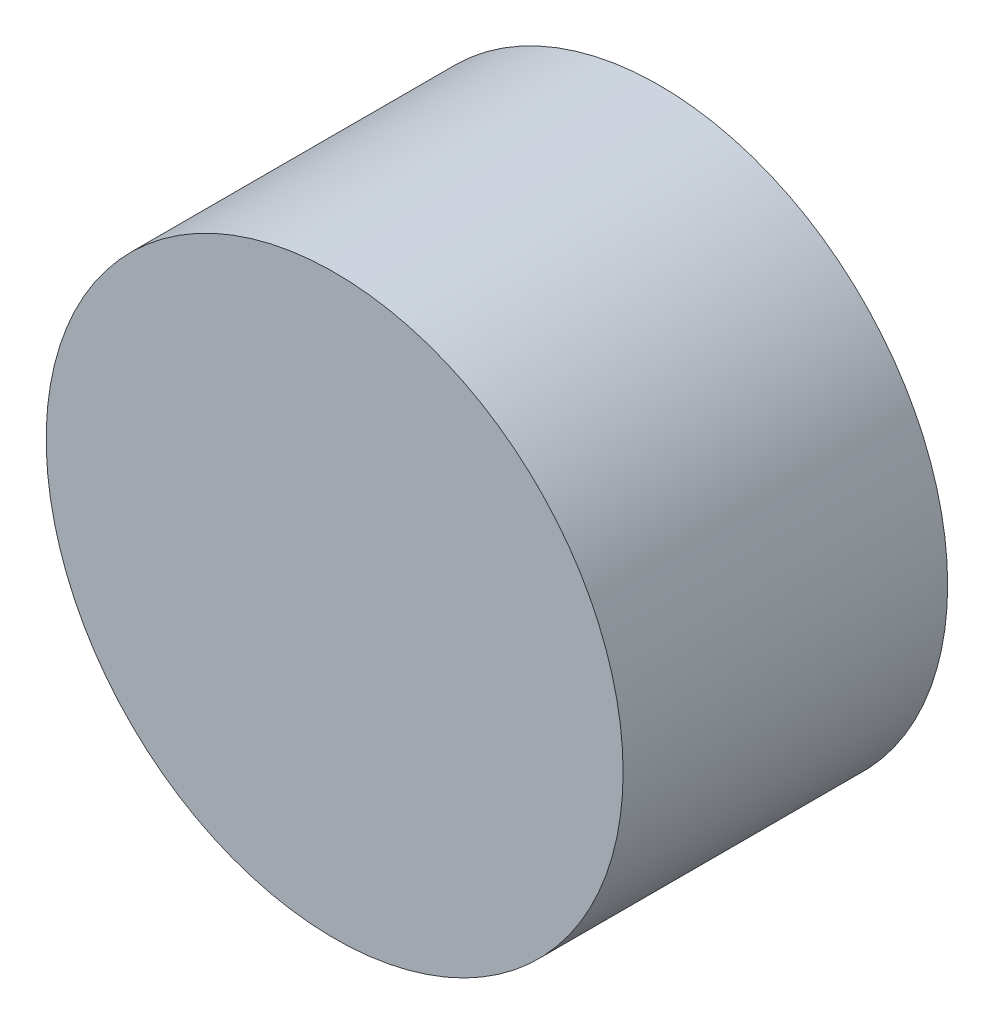
ISO-10303-21;
HEADER;
FILE_DESCRIPTION(('STEP AP214'),'2;1');
FILE_NAME('part.step','',(''),(''),'','','');
FILE_SCHEMA(('AUTOMOTIVE_DESIGN { 1 0 10303 214 1 1 1 1 }'));
ENDSEC;
DATA;
#1=APPLICATION_CONTEXT('core data for automotive mechanical design processes');
#2=APPLICATION_PROTOCOL_DEFINITION('international standard','automotive_design',2000,#1);
#3=PRODUCT_CONTEXT('',#1,'mechanical');
#4=PRODUCT('Part','Part','',(#3));
#5=PRODUCT_RELATED_PRODUCT_CATEGORY('part','',(#4));
#6=PRODUCT_DEFINITION_FORMATION('','',#4);
#7=PRODUCT_DEFINITION_CONTEXT('part definition',#1,'design');
#8=PRODUCT_DEFINITION('design','',#6,#7);
#9=PRODUCT_DEFINITION_SHAPE('','',#8);
#10=(LENGTH_UNIT() NAMED_UNIT(*) SI_UNIT(.MILLI.,.METRE.));
#11=(NAMED_UNIT(*) PLANE_ANGLE_UNIT() SI_UNIT($,.RADIAN.));
#12=(NAMED_UNIT(*) SI_UNIT($,.STERADIAN.) SOLID_ANGLE_UNIT());
#13=UNCERTAINTY_MEASURE_WITH_UNIT(LENGTH_MEASURE(1.E-05),#10,'distance_accuracy_value','');
#14=(GEOMETRIC_REPRESENTATION_CONTEXT(3) GLOBAL_UNCERTAINTY_ASSIGNED_CONTEXT((#13)) GLOBAL_UNIT_ASSIGNED_CONTEXT((#10,
#11,#12)) REPRESENTATION_CONTEXT('',''));
#15=CARTESIAN_POINT('',(0.,0.,0.));
#16=DIRECTION('',(0.,0.,1.));
#17=DIRECTION('',(1.,0.,0.));
#18=AXIS2_PLACEMENT_3D('',#15,#16,#17);
#19=CARTESIAN_POINT('',(0.,0.,-90.));
#20=DIRECTION('',(0.,0.,1.));
#21=DIRECTION('',(1.,0.,0.));
#22=AXIS2_PLACEMENT_3D('',#19,#20,#21);
#23=CYLINDRICAL_SURFACE('',#22,80.);
#24=CARTESIAN_POINT('',(0.,0.,-90.));
#25=DIRECTION('',(0.,0.,1.));
#26=DIRECTION('',(1.,0.,0.));
#27=AXIS2_PLACEMENT_3D('',#24,#25,#26);
#28=CIRCLE('',#27,80.);
#29=CARTESIAN_POINT('',(80.,0.,-90.));
#30=VERTEX_POINT('',#29);
#31=EDGE_CURVE('E10',#30,#30,#28,.T.);
#32=ORIENTED_EDGE('',*,*,#31,.T.);
#33=EDGE_LOOP('',(#32));
#34=FACE_BOUND('',#33,.T.);
#35=CARTESIAN_POINT('',(0.,0.,0.));
#36=DIRECTION('',(0.,0.,1.));
#37=DIRECTION('',(1.,0.,0.));
#38=AXIS2_PLACEMENT_3D('',#35,#36,#37);
#39=CIRCLE('',#38,80.);
#40=CARTESIAN_POINT('',(80.,0.,0.));
#41=VERTEX_POINT('',#40);
#42=EDGE_CURVE('E34',#41,#41,#39,.T.);
#43=ORIENTED_EDGE('',*,*,#42,.F.);
#44=EDGE_LOOP('',(#43));
#45=FACE_BOUND('',#44,.T.);
#46=ADVANCED_FACE('F31',(#34,#45),#23,.T.);
#47=CARTESIAN_POINT('',(0.,0.,-90.));
#48=DIRECTION('',(0.,0.,1.));
#49=DIRECTION('',(1.,0.,0.));
#50=AXIS2_PLACEMENT_3D('',#47,#48,#49);
#51=PLANE('',#50);
#52=ORIENTED_EDGE('',*,*,#31,.F.);
#53=EDGE_LOOP('',(#52));
#54=FACE_BOUND('',#53,.T.);
#55=ADVANCED_FACE('F46',(#54),#51,.F.);
#56=CARTESIAN_POINT('',(0.,0.,0.));
#57=DIRECTION('',(0.,0.,1.));
#58=DIRECTION('',(1.,0.,0.));
#59=AXIS2_PLACEMENT_3D('',#56,#57,#58);
#60=PLANE('',#59);
#61=ORIENTED_EDGE('',*,*,#42,.T.);
#62=EDGE_LOOP('',(#61));
#63=FACE_BOUND('',#62,.T.);
#64=ADVANCED_FACE('F43',(#63),#60,.T.);
#65=CLOSED_SHELL('',(#46,#55,#64));
#66=MANIFOLD_SOLID_BREP('B2',#65);
#67=ADVANCED_BREP_SHAPE_REPRESENTATION('',(#18,#66),#14);
#68=SHAPE_DEFINITION_REPRESENTATION(#9,#67);
ENDSEC;
END-ISO-10303-21;
